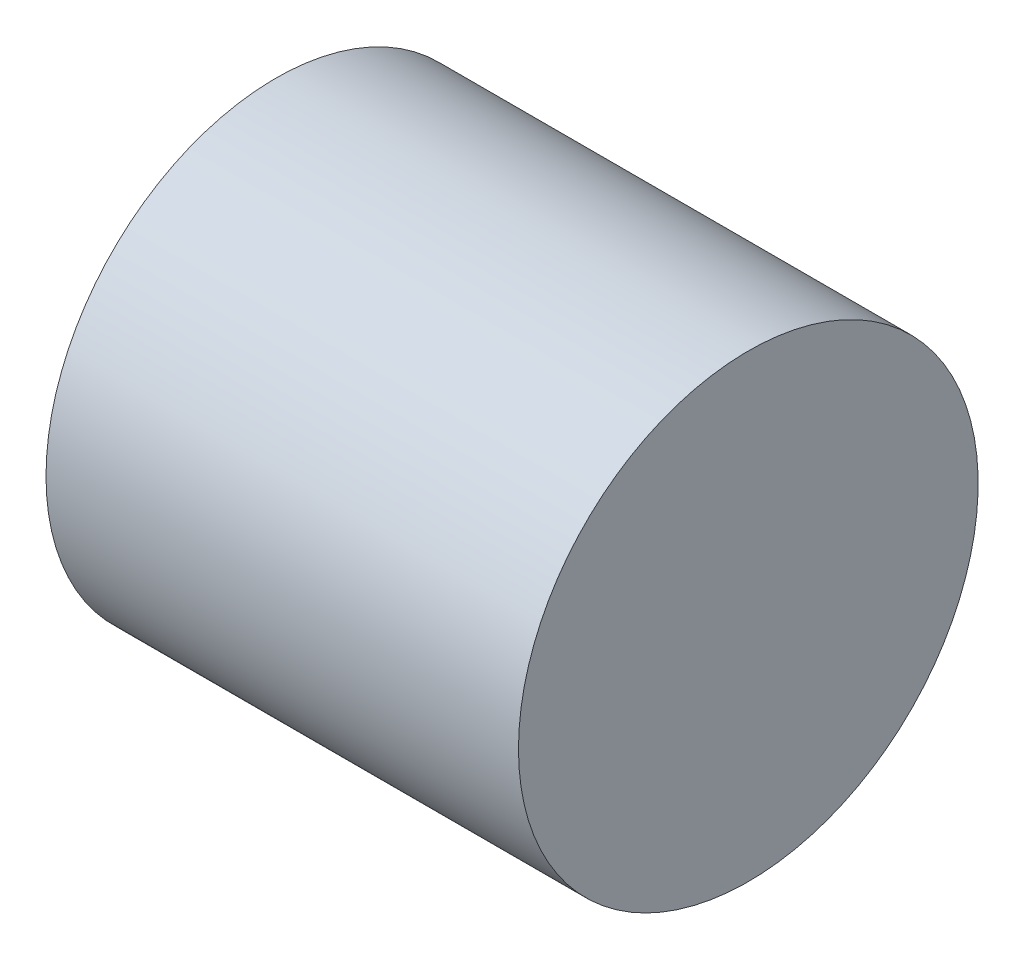
ISO-10303-21;
HEADER;
FILE_DESCRIPTION(('STEP AP214'),'2;1');
FILE_NAME('part.step','',(''),(''),'','','');
FILE_SCHEMA(('AUTOMOTIVE_DESIGN { 1 0 10303 214 1 1 1 1 }'));
ENDSEC;
DATA;
#1=APPLICATION_CONTEXT('core data for automotive mechanical design processes');
#2=APPLICATION_PROTOCOL_DEFINITION('international standard','automotive_design',2000,#1);
#3=PRODUCT_CONTEXT('',#1,'mechanical');
#4=PRODUCT('Part','Part','',(#3));
#5=PRODUCT_RELATED_PRODUCT_CATEGORY('part','',(#4));
#6=PRODUCT_DEFINITION_FORMATION('','',#4);
#7=PRODUCT_DEFINITION_CONTEXT('part definition',#1,'design');
#8=PRODUCT_DEFINITION('design','',#6,#7);
#9=PRODUCT_DEFINITION_SHAPE('','',#8);
#10=(LENGTH_UNIT() NAMED_UNIT(*) SI_UNIT(.MILLI.,.METRE.));
#11=(NAMED_UNIT(*) PLANE_ANGLE_UNIT() SI_UNIT($,.RADIAN.));
#12=(NAMED_UNIT(*) SI_UNIT($,.STERADIAN.) SOLID_ANGLE_UNIT());
#13=UNCERTAINTY_MEASURE_WITH_UNIT(LENGTH_MEASURE(1.E-05),#10,'distance_accuracy_value','');
#14=(GEOMETRIC_REPRESENTATION_CONTEXT(3) GLOBAL_UNCERTAINTY_ASSIGNED_CONTEXT((#13)) GLOBAL_UNIT_ASSIGNED_CONTEXT((#10,
#11,#12)) REPRESENTATION_CONTEXT('',''));
#15=CARTESIAN_POINT('',(0.,0.,0.));
#16=DIRECTION('',(0.,0.,1.));
#17=DIRECTION('',(1.,0.,0.));
#18=AXIS2_PLACEMENT_3D('',#15,#16,#17);
#19=CARTESIAN_POINT('',(924.042101587655,0.,0.));
#20=DIRECTION('',(-1.,0.,0.));
#21=DIRECTION('',(0.,0.,1.));
#22=AXIS2_PLACEMENT_3D('',#19,#20,#21);
#23=PLANE('',#22);
#24=CARTESIAN_POINT('',(924.042101587655,0.,0.));
#25=DIRECTION('',(-1.,0.,0.));
#26=DIRECTION('',(0.,0.,1.));
#27=AXIS2_PLACEMENT_3D('',#24,#25,#26);
#28=CIRCLE('',#27,900.);
#29=CARTESIAN_POINT('',(924.042101587655,0.,900.));
#30=VERTEX_POINT('',#29);
#31=EDGE_CURVE('E10',#30,#30,#28,.T.);
#32=ORIENTED_EDGE('',*,*,#31,.F.);
#33=EDGE_LOOP('',(#32));
#34=FACE_BOUND('',#33,.T.);
#35=ADVANCED_FACE('F37',(#34),#23,.F.);
#36=CARTESIAN_POINT('',(-937.069009523457,0.,0.));
#37=DIRECTION('',(-1.,0.,0.));
#38=DIRECTION('',(0.,0.,1.));
#39=AXIS2_PLACEMENT_3D('',#36,#37,#38);
#40=CYLINDRICAL_SURFACE('',#39,900.);
#41=CARTESIAN_POINT('',(-925.957898412346,0.,0.));
#42=DIRECTION('',(-1.,0.,0.));
#43=DIRECTION('',(0.,0.,1.));
#44=AXIS2_PLACEMENT_3D('',#41,#42,#43);
#45=CIRCLE('',#44,900.);
#46=CARTESIAN_POINT('',(-925.957898412346,0.,900.));
#47=VERTEX_POINT('',#46);
#48=EDGE_CURVE('E43',#47,#47,#45,.T.);
#49=ORIENTED_EDGE('',*,*,#48,.F.);
#50=EDGE_LOOP('',(#49));
#51=FACE_BOUND('',#50,.T.);
#52=ORIENTED_EDGE('',*,*,#31,.T.);
#53=EDGE_LOOP('',(#52));
#54=FACE_BOUND('',#53,.T.);
#55=ADVANCED_FACE('F67',(#51,#54),#40,.T.);
#56=CARTESIAN_POINT('',(-925.957898412345,900.,0.));
#57=DIRECTION('',(1.,0.,0.));
#58=DIRECTION('',(0.,0.,-1.));
#59=AXIS2_PLACEMENT_3D('',#56,#57,#58);
#60=PLANE('',#59);
#61=CARTESIAN_POINT('',(-925.957898412345,0.,0.));
#62=DIRECTION('',(-1.,0.,0.));
#63=DIRECTION('',(0.,0.,1.));
#64=AXIS2_PLACEMENT_3D('',#61,#62,#63);
#65=CIRCLE('',#64,50.);
#66=CARTESIAN_POINT('',(-925.957898412345,0.,50.));
#67=VERTEX_POINT('',#66);
#68=EDGE_CURVE('E47',#67,#67,#65,.T.);
#69=ORIENTED_EDGE('',*,*,#68,.F.);
#70=EDGE_LOOP('',(#69));
#71=FACE_BOUND('',#70,.T.);
#72=ORIENTED_EDGE('',*,*,#48,.T.);
#73=EDGE_LOOP('',(#72));
#74=FACE_BOUND('',#73,.T.);
#75=ADVANCED_FACE('F62',(#71,#74),#60,.F.);
#76=CARTESIAN_POINT('',(-937.069009523457,0.,0.));
#77=DIRECTION('',(-1.,0.,0.));
#78=DIRECTION('',(0.,0.,1.));
#79=AXIS2_PLACEMENT_3D('',#76,#77,#78);
#80=CYLINDRICAL_SURFACE('',#79,50.);
#81=CARTESIAN_POINT('',(-825.957898412345,0.,0.));
#82=DIRECTION('',(-1.,0.,0.));
#83=DIRECTION('',(0.,0.,1.));
#84=AXIS2_PLACEMENT_3D('',#81,#82,#83);
#85=CIRCLE('',#84,50.);
#86=CARTESIAN_POINT('',(-825.957898412345,0.,50.));
#87=VERTEX_POINT('',#86);
#88=EDGE_CURVE('E51',#87,#87,#85,.T.);
#89=ORIENTED_EDGE('',*,*,#88,.F.);
#90=EDGE_LOOP('',(#89));
#91=FACE_BOUND('',#90,.T.);
#92=ORIENTED_EDGE('',*,*,#68,.T.);
#93=EDGE_LOOP('',(#92));
#94=FACE_BOUND('',#93,.T.);
#95=ADVANCED_FACE('F59',(#91,#94),#80,.F.);
#96=CARTESIAN_POINT('',(-825.957898412345,50.,0.));
#97=DIRECTION('',(1.,0.,0.));
#98=DIRECTION('',(0.,0.,-1.));
#99=AXIS2_PLACEMENT_3D('',#96,#97,#98);
#100=PLANE('',#99);
#101=ORIENTED_EDGE('',*,*,#88,.T.);
#102=EDGE_LOOP('',(#101));
#103=FACE_BOUND('',#102,.T.);
#104=ADVANCED_FACE('F57',(#103),#100,.F.);
#105=CLOSED_SHELL('',(#35,#55,#75,#95,#104));
#106=MANIFOLD_SOLID_BREP('B2',#105);
#107=ADVANCED_BREP_SHAPE_REPRESENTATION('',(#18,#106),#14);
#108=SHAPE_DEFINITION_REPRESENTATION(#9,#107);
ENDSEC;
END-ISO-10303-21;
